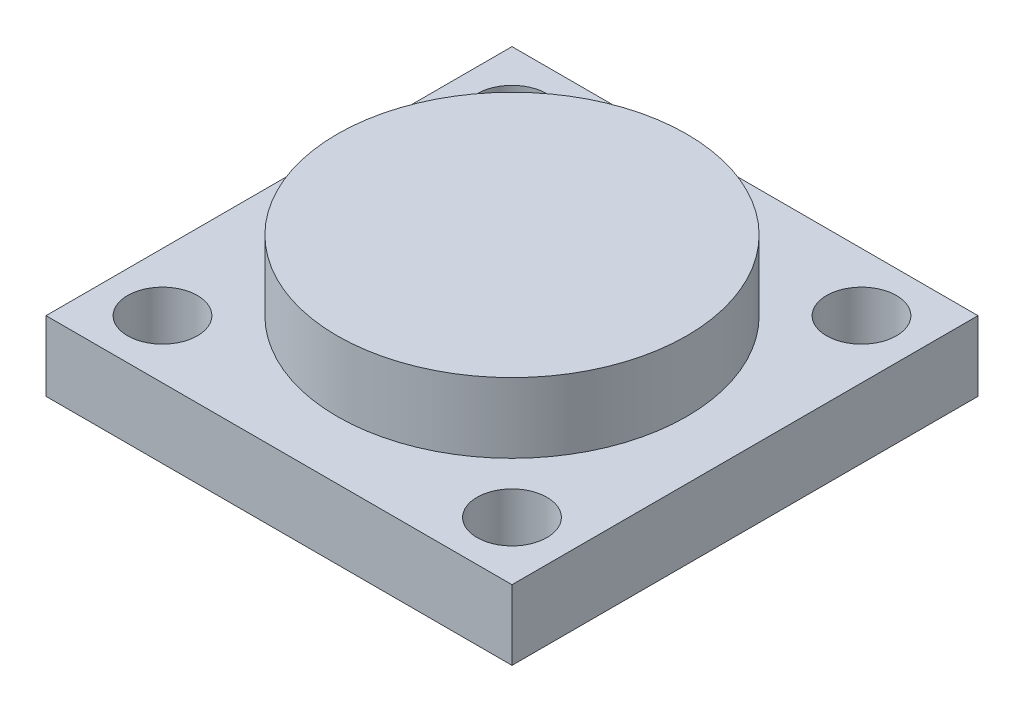
ISO-10303-21;
HEADER;
FILE_DESCRIPTION(('STEP AP214'),'2;1');
FILE_NAME('part.step','',(''),(''),'','','');
FILE_SCHEMA(('AUTOMOTIVE_DESIGN { 1 0 10303 214 1 1 1 1 }'));
ENDSEC;
DATA;
#1=APPLICATION_CONTEXT('core data for automotive mechanical design processes');
#2=APPLICATION_PROTOCOL_DEFINITION('international standard','automotive_design',2000,#1);
#3=PRODUCT_CONTEXT('',#1,'mechanical');
#4=PRODUCT('Part','Part','',(#3));
#5=PRODUCT_RELATED_PRODUCT_CATEGORY('part','',(#4));
#6=PRODUCT_DEFINITION_FORMATION('','',#4);
#7=PRODUCT_DEFINITION_CONTEXT('part definition',#1,'design');
#8=PRODUCT_DEFINITION('design','',#6,#7);
#9=PRODUCT_DEFINITION_SHAPE('','',#8);
#10=(LENGTH_UNIT() NAMED_UNIT(*) SI_UNIT(.MILLI.,.METRE.));
#11=(NAMED_UNIT(*) PLANE_ANGLE_UNIT() SI_UNIT($,.RADIAN.));
#12=(NAMED_UNIT(*) SI_UNIT($,.STERADIAN.) SOLID_ANGLE_UNIT());
#13=UNCERTAINTY_MEASURE_WITH_UNIT(LENGTH_MEASURE(1.E-05),#10,'distance_accuracy_value','');
#14=(GEOMETRIC_REPRESENTATION_CONTEXT(3) GLOBAL_UNCERTAINTY_ASSIGNED_CONTEXT((#13)) GLOBAL_UNIT_ASSIGNED_CONTEXT((#10,
#11,#12)) REPRESENTATION_CONTEXT('',''));
#15=CARTESIAN_POINT('',(0.,0.,0.));
#16=DIRECTION('',(0.,0.,1.));
#17=DIRECTION('',(1.,0.,0.));
#18=AXIS2_PLACEMENT_3D('',#15,#16,#17);
#19=CARTESIAN_POINT('',(-100.,30.,-100.));
#20=DIRECTION('',(1.,0.,0.));
#21=DIRECTION('',(0.,0.,-1.));
#22=AXIS2_PLACEMENT_3D('',#19,#20,#21);
#23=PLANE('',#22);
#24=DIRECTION('',(0.,0.,1.));
#25=VECTOR('',#24,1.);
#26=CARTESIAN_POINT('',(-100.,0.,-100.));
#27=LINE('',#26,#25);
#28=CARTESIAN_POINT('',(-100.,0.,-100.));
#29=VERTEX_POINT('',#28);
#30=CARTESIAN_POINT('',(-100.,0.,100.));
#31=VERTEX_POINT('',#30);
#32=EDGE_CURVE('E104',#29,#31,#27,.T.);
#33=ORIENTED_EDGE('',*,*,#32,.T.);
#34=DIRECTION('',(0.,-1.,0.));
#35=VECTOR('',#34,1.);
#36=CARTESIAN_POINT('',(-100.,30.,100.));
#37=LINE('',#36,#35);
#38=CARTESIAN_POINT('',(-100.,30.,100.));
#39=VERTEX_POINT('',#38);
#40=EDGE_CURVE('E41',#39,#31,#37,.T.);
#41=ORIENTED_EDGE('',*,*,#40,.F.);
#42=DIRECTION('',(0.,0.,1.));
#43=VECTOR('',#42,1.);
#44=CARTESIAN_POINT('',(-100.,30.,-100.));
#45=LINE('',#44,#43);
#46=CARTESIAN_POINT('',(-100.,30.,-100.));
#47=VERTEX_POINT('',#46);
#48=EDGE_CURVE('E89',#47,#39,#45,.T.);
#49=ORIENTED_EDGE('',*,*,#48,.F.);
#50=DIRECTION('',(0.,-1.,0.));
#51=VECTOR('',#50,1.);
#52=CARTESIAN_POINT('',(-100.,30.,-100.));
#53=LINE('',#52,#51);
#54=EDGE_CURVE('E55',#47,#29,#53,.T.);
#55=ORIENTED_EDGE('',*,*,#54,.T.);
#56=EDGE_LOOP('',(#33,#41,#49,#55));
#57=FACE_BOUND('',#56,.T.);
#58=ADVANCED_FACE('F38',(#57),#23,.F.);
#59=CARTESIAN_POINT('',(-100.,30.,100.));
#60=DIRECTION('',(0.,0.,-1.));
#61=DIRECTION('',(-1.,0.,0.));
#62=AXIS2_PLACEMENT_3D('',#59,#60,#61);
#63=PLANE('',#62);
#64=DIRECTION('',(1.,0.,0.));
#65=VECTOR('',#64,1.);
#66=CARTESIAN_POINT('',(-100.,0.,100.));
#67=LINE('',#66,#65);
#68=CARTESIAN_POINT('',(100.,0.,100.));
#69=VERTEX_POINT('',#68);
#70=EDGE_CURVE('E95',#31,#69,#67,.T.);
#71=ORIENTED_EDGE('',*,*,#70,.T.);
#72=DIRECTION('',(0.,-1.,0.));
#73=VECTOR('',#72,1.);
#74=CARTESIAN_POINT('',(100.,30.,100.));
#75=LINE('',#74,#73);
#76=CARTESIAN_POINT('',(100.,30.,100.));
#77=VERTEX_POINT('',#76);
#78=EDGE_CURVE('E93',#77,#69,#75,.T.);
#79=ORIENTED_EDGE('',*,*,#78,.F.);
#80=DIRECTION('',(1.,0.,0.));
#81=VECTOR('',#80,1.);
#82=CARTESIAN_POINT('',(-100.,30.,100.));
#83=LINE('',#82,#81);
#84=EDGE_CURVE('E81',#39,#77,#83,.T.);
#85=ORIENTED_EDGE('',*,*,#84,.F.);
#86=ORIENTED_EDGE('',*,*,#40,.T.);
#87=EDGE_LOOP('',(#71,#79,#85,#86));
#88=FACE_BOUND('',#87,.T.);
#89=ADVANCED_FACE('F94',(#88),#63,.F.);
#90=CARTESIAN_POINT('',(100.,30.,-100.));
#91=DIRECTION('',(1.,0.,0.));
#92=DIRECTION('',(0.,0.,-1.));
#93=AXIS2_PLACEMENT_3D('',#90,#91,#92);
#94=PLANE('',#93);
#95=DIRECTION('',(0.,0.,1.));
#96=VECTOR('',#95,1.);
#97=CARTESIAN_POINT('',(100.,0.,-100.));
#98=LINE('',#97,#96);
#99=CARTESIAN_POINT('',(100.,0.,-100.));
#100=VERTEX_POINT('',#99);
#101=EDGE_CURVE('E108',#100,#69,#98,.T.);
#102=ORIENTED_EDGE('',*,*,#101,.F.);
#103=DIRECTION('',(0.,-1.,0.));
#104=VECTOR('',#103,1.);
#105=CARTESIAN_POINT('',(100.,30.,-100.));
#106=LINE('',#105,#104);
#107=CARTESIAN_POINT('',(100.,30.,-100.));
#108=VERTEX_POINT('',#107);
#109=EDGE_CURVE('E69',#108,#100,#106,.T.);
#110=ORIENTED_EDGE('',*,*,#109,.F.);
#111=DIRECTION('',(0.,0.,1.));
#112=VECTOR('',#111,1.);
#113=CARTESIAN_POINT('',(100.,30.,-100.));
#114=LINE('',#113,#112);
#115=EDGE_CURVE('E88',#108,#77,#114,.T.);
#116=ORIENTED_EDGE('',*,*,#115,.T.);
#117=ORIENTED_EDGE('',*,*,#78,.T.);
#118=EDGE_LOOP('',(#102,#110,#116,#117));
#119=FACE_BOUND('',#118,.T.);
#120=ADVANCED_FACE('F98',(#119),#94,.T.);
#121=CARTESIAN_POINT('',(-100.,30.,-100.));
#122=DIRECTION('',(0.,0.,-1.));
#123=DIRECTION('',(-1.,0.,0.));
#124=AXIS2_PLACEMENT_3D('',#121,#122,#123);
#125=PLANE('',#124);
#126=DIRECTION('',(1.,0.,0.));
#127=VECTOR('',#126,1.);
#128=CARTESIAN_POINT('',(-100.,0.,-100.));
#129=LINE('',#128,#127);
#130=EDGE_CURVE('E110',#29,#100,#129,.T.);
#131=ORIENTED_EDGE('',*,*,#130,.F.);
#132=ORIENTED_EDGE('',*,*,#54,.F.);
#133=DIRECTION('',(1.,0.,0.));
#134=VECTOR('',#133,1.);
#135=CARTESIAN_POINT('',(-100.,30.,-100.));
#136=LINE('',#135,#134);
#137=EDGE_CURVE('E99',#47,#108,#136,.T.);
#138=ORIENTED_EDGE('',*,*,#137,.T.);
#139=ORIENTED_EDGE('',*,*,#109,.T.);
#140=EDGE_LOOP('',(#131,#132,#138,#139));
#141=FACE_BOUND('',#140,.T.);
#142=ADVANCED_FACE('F148',(#141),#125,.T.);
#143=CARTESIAN_POINT('',(0.,30.,0.));
#144=DIRECTION('',(0.,1.,0.));
#145=DIRECTION('',(0.,0.,1.));
#146=AXIS2_PLACEMENT_3D('',#143,#144,#145);
#147=PLANE('',#146);
#148=CARTESIAN_POINT('',(-75.,30.,75.));
#149=DIRECTION('',(0.,1.,0.));
#150=DIRECTION('',(0.,0.,1.));
#151=AXIS2_PLACEMENT_3D('',#148,#149,#150);
#152=CIRCLE('',#151,15.);
#153=CARTESIAN_POINT('',(-75.,30.,90.));
#154=VERTEX_POINT('',#153);
#155=EDGE_CURVE('E122',#154,#154,#152,.T.);
#156=ORIENTED_EDGE('',*,*,#155,.F.);
#157=EDGE_LOOP('',(#156));
#158=FACE_BOUND('',#157,.T.);
#159=CARTESIAN_POINT('',(75.,30.,-75.));
#160=DIRECTION('',(0.,1.,0.));
#161=DIRECTION('',(0.,0.,1.));
#162=AXIS2_PLACEMENT_3D('',#159,#160,#161);
#163=CIRCLE('',#162,15.);
#164=CARTESIAN_POINT('',(75.,30.,-60.));
#165=VERTEX_POINT('',#164);
#166=EDGE_CURVE('E128',#165,#165,#163,.T.);
#167=ORIENTED_EDGE('',*,*,#166,.F.);
#168=EDGE_LOOP('',(#167));
#169=FACE_BOUND('',#168,.T.);
#170=CARTESIAN_POINT('',(75.,30.,75.));
#171=DIRECTION('',(0.,1.,0.));
#172=DIRECTION('',(0.,0.,1.));
#173=AXIS2_PLACEMENT_3D('',#170,#171,#172);
#174=CIRCLE('',#173,15.);
#175=CARTESIAN_POINT('',(75.,30.,90.));
#176=VERTEX_POINT('',#175);
#177=EDGE_CURVE('E129',#176,#176,#174,.T.);
#178=ORIENTED_EDGE('',*,*,#177,.F.);
#179=EDGE_LOOP('',(#178));
#180=FACE_BOUND('',#179,.T.);
#181=CARTESIAN_POINT('',(-75.,30.,-75.));
#182=DIRECTION('',(0.,1.,0.));
#183=DIRECTION('',(0.,0.,1.));
#184=AXIS2_PLACEMENT_3D('',#181,#182,#183);
#185=CIRCLE('',#184,15.);
#186=CARTESIAN_POINT('',(-75.,30.,-60.));
#187=VERTEX_POINT('',#186);
#188=EDGE_CURVE('E119',#187,#187,#185,.T.);
#189=ORIENTED_EDGE('',*,*,#188,.F.);
#190=EDGE_LOOP('',(#189));
#191=FACE_BOUND('',#190,.T.);
#192=CARTESIAN_POINT('',(0.,30.,0.));
#193=DIRECTION('',(0.,1.,0.));
#194=DIRECTION('',(0.,0.,1.));
#195=AXIS2_PLACEMENT_3D('',#192,#193,#194);
#196=CIRCLE('',#195,75.);
#197=CARTESIAN_POINT('',(0.,30.,75.));
#198=VERTEX_POINT('',#197);
#199=EDGE_CURVE('E11',#198,#198,#196,.T.);
#200=ORIENTED_EDGE('',*,*,#199,.F.);
#201=EDGE_LOOP('',(#200));
#202=FACE_BOUND('',#201,.T.);
#203=ORIENTED_EDGE('',*,*,#48,.T.);
#204=ORIENTED_EDGE('',*,*,#84,.T.);
#205=ORIENTED_EDGE('',*,*,#115,.F.);
#206=ORIENTED_EDGE('',*,*,#137,.F.);
#207=EDGE_LOOP('',(#203,#204,#205,#206));
#208=FACE_BOUND('',#207,.T.);
#209=ADVANCED_FACE('F85',(#158,#169,#180,#191,#202,#208),#147,.T.);
#210=CARTESIAN_POINT('',(0.,0.,0.));
#211=DIRECTION('',(0.,1.,0.));
#212=DIRECTION('',(0.,0.,1.));
#213=AXIS2_PLACEMENT_3D('',#210,#211,#212);
#214=PLANE('',#213);
#215=CARTESIAN_POINT('',(-75.,0.,75.));
#216=DIRECTION('',(0.,1.,0.));
#217=DIRECTION('',(0.,0.,1.));
#218=AXIS2_PLACEMENT_3D('',#215,#216,#217);
#219=CIRCLE('',#218,15.);
#220=CARTESIAN_POINT('',(-75.,0.,90.));
#221=VERTEX_POINT('',#220);
#222=EDGE_CURVE('E132',#221,#221,#219,.T.);
#223=ORIENTED_EDGE('',*,*,#222,.T.);
#224=EDGE_LOOP('',(#223));
#225=FACE_BOUND('',#224,.T.);
#226=CARTESIAN_POINT('',(75.,0.,-75.));
#227=DIRECTION('',(0.,1.,0.));
#228=DIRECTION('',(0.,0.,1.));
#229=AXIS2_PLACEMENT_3D('',#226,#227,#228);
#230=CIRCLE('',#229,15.);
#231=CARTESIAN_POINT('',(75.,0.,-60.));
#232=VERTEX_POINT('',#231);
#233=EDGE_CURVE('E125',#232,#232,#230,.T.);
#234=ORIENTED_EDGE('',*,*,#233,.T.);
#235=EDGE_LOOP('',(#234));
#236=FACE_BOUND('',#235,.T.);
#237=CARTESIAN_POINT('',(75.,0.,75.));
#238=DIRECTION('',(0.,1.,0.));
#239=DIRECTION('',(0.,0.,1.));
#240=AXIS2_PLACEMENT_3D('',#237,#238,#239);
#241=CIRCLE('',#240,15.);
#242=CARTESIAN_POINT('',(75.,0.,90.));
#243=VERTEX_POINT('',#242);
#244=EDGE_CURVE('E137',#243,#243,#241,.T.);
#245=ORIENTED_EDGE('',*,*,#244,.T.);
#246=EDGE_LOOP('',(#245));
#247=FACE_BOUND('',#246,.T.);
#248=CARTESIAN_POINT('',(-75.,0.,-75.));
#249=DIRECTION('',(0.,1.,0.));
#250=DIRECTION('',(0.,0.,1.));
#251=AXIS2_PLACEMENT_3D('',#248,#249,#250);
#252=CIRCLE('',#251,15.);
#253=CARTESIAN_POINT('',(-75.,0.,-60.));
#254=VERTEX_POINT('',#253);
#255=EDGE_CURVE('E118',#254,#254,#252,.T.);
#256=ORIENTED_EDGE('',*,*,#255,.T.);
#257=EDGE_LOOP('',(#256));
#258=FACE_BOUND('',#257,.T.);
#259=ORIENTED_EDGE('',*,*,#32,.F.);
#260=ORIENTED_EDGE('',*,*,#130,.T.);
#261=ORIENTED_EDGE('',*,*,#101,.T.);
#262=ORIENTED_EDGE('',*,*,#70,.F.);
#263=EDGE_LOOP('',(#259,#260,#261,#262));
#264=FACE_BOUND('',#263,.T.);
#265=ADVANCED_FACE('F147',(#225,#236,#247,#258,#264),#214,.F.);
#266=CARTESIAN_POINT('',(0.,60.,0.));
#267=DIRECTION('',(0.,-1.,0.));
#268=DIRECTION('',(0.,0.,-1.));
#269=AXIS2_PLACEMENT_3D('',#266,#267,#268);
#270=CYLINDRICAL_SURFACE('',#269,75.);
#271=CARTESIAN_POINT('',(0.,60.,0.));
#272=DIRECTION('',(0.,1.,0.));
#273=DIRECTION('',(0.,0.,1.));
#274=AXIS2_PLACEMENT_3D('',#271,#272,#273);
#275=CIRCLE('',#274,75.);
#276=CARTESIAN_POINT('',(0.,60.,75.));
#277=VERTEX_POINT('',#276);
#278=EDGE_CURVE('E106',#277,#277,#275,.T.);
#279=ORIENTED_EDGE('',*,*,#278,.F.);
#280=EDGE_LOOP('',(#279));
#281=FACE_BOUND('',#280,.T.);
#282=ORIENTED_EDGE('',*,*,#199,.T.);
#283=EDGE_LOOP('',(#282));
#284=FACE_BOUND('',#283,.T.);
#285=ADVANCED_FACE('F155',(#281,#284),#270,.T.);
#286=CARTESIAN_POINT('',(0.,60.,0.));
#287=DIRECTION('',(0.,1.,0.));
#288=DIRECTION('',(0.,0.,1.));
#289=AXIS2_PLACEMENT_3D('',#286,#287,#288);
#290=PLANE('',#289);
#291=ORIENTED_EDGE('',*,*,#278,.T.);
#292=EDGE_LOOP('',(#291));
#293=FACE_BOUND('',#292,.T.);
#294=ADVANCED_FACE('F157',(#293),#290,.T.);
#295=CARTESIAN_POINT('',(-75.,0.,-75.));
#296=DIRECTION('',(0.,1.,0.));
#297=DIRECTION('',(0.,0.,1.));
#298=AXIS2_PLACEMENT_3D('',#295,#296,#297);
#299=CYLINDRICAL_SURFACE('',#298,15.);
#300=ORIENTED_EDGE('',*,*,#255,.F.);
#301=EDGE_LOOP('',(#300));
#302=FACE_BOUND('',#301,.T.);
#303=ORIENTED_EDGE('',*,*,#188,.T.);
#304=EDGE_LOOP('',(#303));
#305=FACE_BOUND('',#304,.T.);
#306=ADVANCED_FACE('F164',(#302,#305),#299,.F.);
#307=CARTESIAN_POINT('',(75.,0.,75.));
#308=DIRECTION('',(0.,1.,0.));
#309=DIRECTION('',(0.,0.,1.));
#310=AXIS2_PLACEMENT_3D('',#307,#308,#309);
#311=CYLINDRICAL_SURFACE('',#310,15.);
#312=ORIENTED_EDGE('',*,*,#244,.F.);
#313=EDGE_LOOP('',(#312));
#314=FACE_BOUND('',#313,.T.);
#315=ORIENTED_EDGE('',*,*,#177,.T.);
#316=EDGE_LOOP('',(#315));
#317=FACE_BOUND('',#316,.T.);
#318=ADVANCED_FACE('F143',(#314,#317),#311,.F.);
#319=CARTESIAN_POINT('',(75.,0.,-75.));
#320=DIRECTION('',(0.,1.,0.));
#321=DIRECTION('',(0.,0.,1.));
#322=AXIS2_PLACEMENT_3D('',#319,#320,#321);
#323=CYLINDRICAL_SURFACE('',#322,15.);
#324=ORIENTED_EDGE('',*,*,#233,.F.);
#325=EDGE_LOOP('',(#324));
#326=FACE_BOUND('',#325,.T.);
#327=ORIENTED_EDGE('',*,*,#166,.T.);
#328=EDGE_LOOP('',(#327));
#329=FACE_BOUND('',#328,.T.);
#330=ADVANCED_FACE('F244',(#326,#329),#323,.F.);
#331=CARTESIAN_POINT('',(-75.,0.,75.));
#332=DIRECTION('',(0.,1.,0.));
#333=DIRECTION('',(0.,0.,1.));
#334=AXIS2_PLACEMENT_3D('',#331,#332,#333);
#335=CYLINDRICAL_SURFACE('',#334,15.);
#336=ORIENTED_EDGE('',*,*,#222,.F.);
#337=EDGE_LOOP('',(#336));
#338=FACE_BOUND('',#337,.T.);
#339=ORIENTED_EDGE('',*,*,#155,.T.);
#340=EDGE_LOOP('',(#339));
#341=FACE_BOUND('',#340,.T.);
#342=ADVANCED_FACE('F254',(#338,#341),#335,.F.);
#343=CLOSED_SHELL('',(#58,#89,#120,#142,#209,#265,#285,#294,#306,#318,#330,#342));
#344=MANIFOLD_SOLID_BREP('B2',#343);
#345=ADVANCED_BREP_SHAPE_REPRESENTATION('',(#18,#344),#14);
#346=SHAPE_DEFINITION_REPRESENTATION(#9,#345);
ENDSEC;
END-ISO-10303-21;
